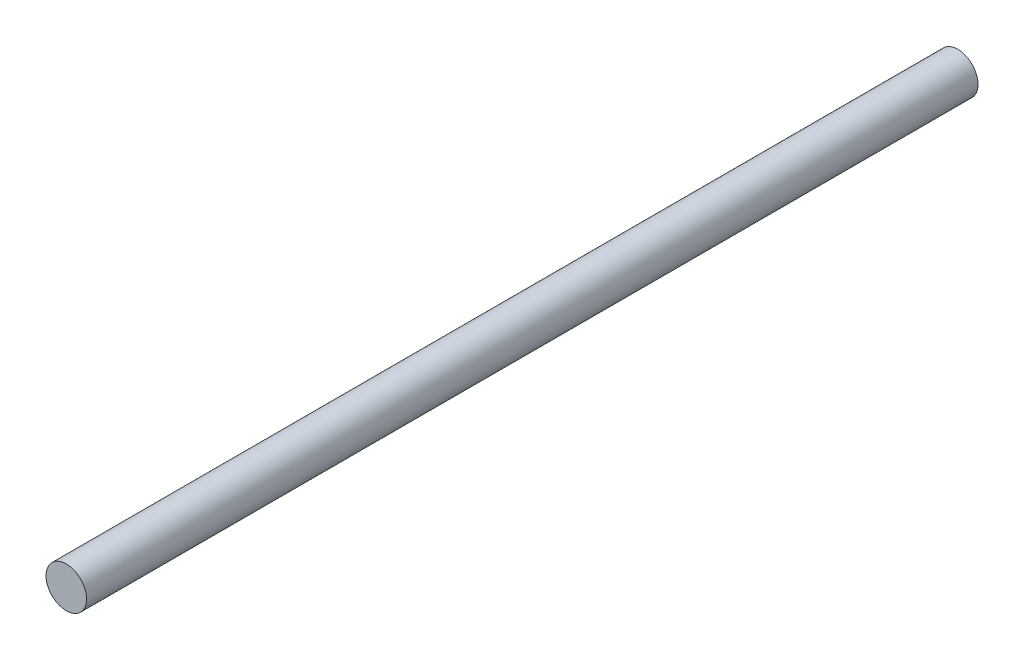
ISO-10303-21;
HEADER;
FILE_DESCRIPTION(('STEP AP214'),'2;1');
FILE_NAME('part.step','',(''),(''),'','','');
FILE_SCHEMA(('AUTOMOTIVE_DESIGN { 1 0 10303 214 1 1 1 1 }'));
ENDSEC;
DATA;
#1=APPLICATION_CONTEXT('core data for automotive mechanical design processes');
#2=APPLICATION_PROTOCOL_DEFINITION('international standard','automotive_design',2000,#1);
#3=PRODUCT_CONTEXT('',#1,'mechanical');
#4=PRODUCT('Part','Part','',(#3));
#5=PRODUCT_RELATED_PRODUCT_CATEGORY('part','',(#4));
#6=PRODUCT_DEFINITION_FORMATION('','',#4);
#7=PRODUCT_DEFINITION_CONTEXT('part definition',#1,'design');
#8=PRODUCT_DEFINITION('design','',#6,#7);
#9=PRODUCT_DEFINITION_SHAPE('','',#8);
#10=(LENGTH_UNIT() NAMED_UNIT(*) SI_UNIT(.MILLI.,.METRE.));
#11=(NAMED_UNIT(*) PLANE_ANGLE_UNIT() SI_UNIT($,.RADIAN.));
#12=(NAMED_UNIT(*) SI_UNIT($,.STERADIAN.) SOLID_ANGLE_UNIT());
#13=UNCERTAINTY_MEASURE_WITH_UNIT(LENGTH_MEASURE(1.E-05),#10,'distance_accuracy_value','');
#14=(GEOMETRIC_REPRESENTATION_CONTEXT(3) GLOBAL_UNCERTAINTY_ASSIGNED_CONTEXT((#13)) GLOBAL_UNIT_ASSIGNED_CONTEXT((#10,
#11,#12)) REPRESENTATION_CONTEXT('',''));
#15=CARTESIAN_POINT('',(0.,0.,0.));
#16=DIRECTION('',(0.,0.,1.));
#17=DIRECTION('',(1.,0.,0.));
#18=AXIS2_PLACEMENT_3D('',#15,#16,#17);
#19=CARTESIAN_POINT('',(0.,0.,249.000000000003));
#20=DIRECTION('',(0.,0.,1.00000000000001));
#21=DIRECTION('',(1.00000000000001,0.,0.));
#22=AXIS2_PLACEMENT_3D('',#19,#20,#21);
#23=PLANE('',#22);
#24=CARTESIAN_POINT('',(0.,0.,249.000000000003));
#25=DIRECTION('',(0.,0.,-1.00000000000001));
#26=DIRECTION('',(-1.00000000000001,0.,0.));
#27=AXIS2_PLACEMENT_3D('',#24,#25,#26);
#28=CIRCLE('',#27,5.665);
#29=CARTESIAN_POINT('',(-5.66500000000008,0.,249.000000000003));
#30=VERTEX_POINT('',#29);
#31=EDGE_CURVE('E25',#30,#30,#28,.T.);
#32=ORIENTED_EDGE('',*,*,#31,.F.);
#33=EDGE_LOOP('',(#32));
#34=FACE_BOUND('',#33,.T.);
#35=ADVANCED_FACE('F22',(#34),#23,.T.);
#36=CARTESIAN_POINT('',(0.,0.,0.));
#37=DIRECTION('',(0.,0.,1.00000000000001));
#38=DIRECTION('',(1.00000000000001,0.,0.));
#39=AXIS2_PLACEMENT_3D('',#36,#37,#38);
#40=PLANE('',#39);
#41=CARTESIAN_POINT('',(0.,0.,0.));
#42=DIRECTION('',(0.,0.,-1.00000000000001));
#43=DIRECTION('',(-1.00000000000001,0.,0.));
#44=AXIS2_PLACEMENT_3D('',#41,#42,#43);
#45=CIRCLE('',#44,5.665);
#46=CARTESIAN_POINT('',(-5.66500000000008,0.,0.));
#47=VERTEX_POINT('',#46);
#48=EDGE_CURVE('E12',#47,#47,#45,.F.);
#49=ORIENTED_EDGE('',*,*,#48,.F.);
#50=EDGE_LOOP('',(#49));
#51=FACE_BOUND('',#50,.T.);
#52=ADVANCED_FACE('F37',(#51),#40,.F.);
#53=CARTESIAN_POINT('',(0.,0.,249.000000000003));
#54=DIRECTION('',(0.,0.,-1.00000000000001));
#55=DIRECTION('',(-1.00000000000001,0.,0.));
#56=AXIS2_PLACEMENT_3D('',#53,#54,#55);
#57=CYLINDRICAL_SURFACE('',#56,5.665);
#58=ORIENTED_EDGE('',*,*,#48,.T.);
#59=EDGE_LOOP('',(#58));
#60=FACE_BOUND('',#59,.T.);
#61=ORIENTED_EDGE('',*,*,#31,.T.);
#62=EDGE_LOOP('',(#61));
#63=FACE_BOUND('',#62,.T.);
#64=ADVANCED_FACE('F34',(#60,#63),#57,.T.);
#65=CLOSED_SHELL('',(#35,#52,#64));
#66=MANIFOLD_SOLID_BREP('B1',#65);
#67=ADVANCED_BREP_SHAPE_REPRESENTATION('',(#18,#66),#14);
#68=SHAPE_DEFINITION_REPRESENTATION(#9,#67);
ENDSEC;
END-ISO-10303-21;
